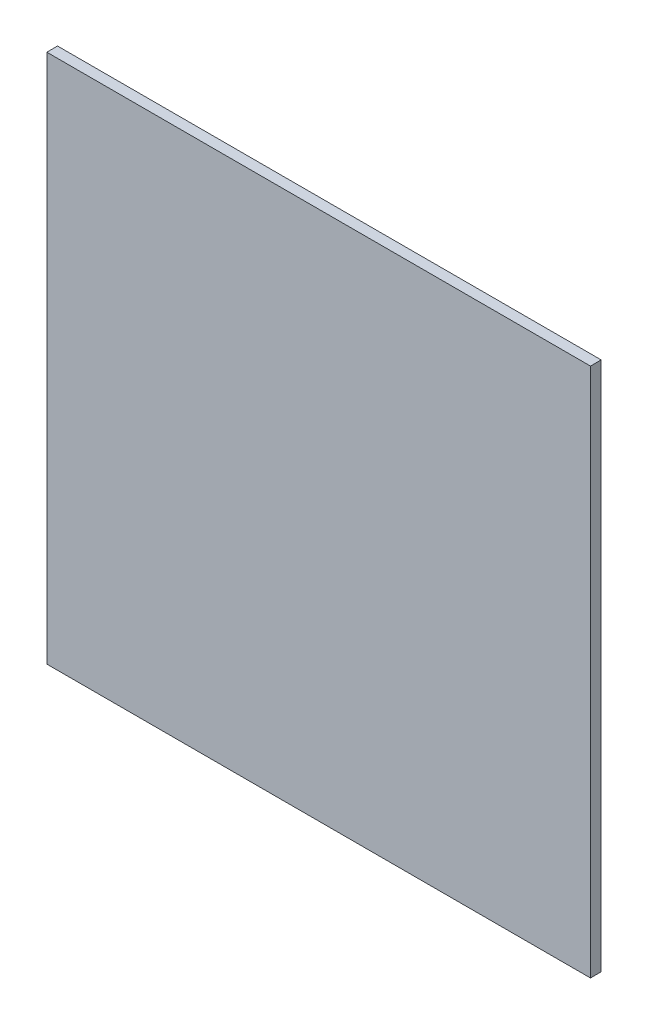
ISO-10303-21;
HEADER;
FILE_DESCRIPTION(('STEP AP214'),'2;1');
FILE_NAME('part.step','',(''),(''),'','','');
FILE_SCHEMA(('AUTOMOTIVE_DESIGN { 1 0 10303 214 1 1 1 1 }'));
ENDSEC;
DATA;
#1=APPLICATION_CONTEXT('core data for automotive mechanical design processes');
#2=APPLICATION_PROTOCOL_DEFINITION('international standard','automotive_design',2000,#1);
#3=PRODUCT_CONTEXT('',#1,'mechanical');
#4=PRODUCT('Part','Part','',(#3));
#5=PRODUCT_RELATED_PRODUCT_CATEGORY('part','',(#4));
#6=PRODUCT_DEFINITION_FORMATION('','',#4);
#7=PRODUCT_DEFINITION_CONTEXT('part definition',#1,'design');
#8=PRODUCT_DEFINITION('design','',#6,#7);
#9=PRODUCT_DEFINITION_SHAPE('','',#8);
#10=(LENGTH_UNIT() NAMED_UNIT(*) SI_UNIT(.MILLI.,.METRE.));
#11=(NAMED_UNIT(*) PLANE_ANGLE_UNIT() SI_UNIT($,.RADIAN.));
#12=(NAMED_UNIT(*) SI_UNIT($,.STERADIAN.) SOLID_ANGLE_UNIT());
#13=UNCERTAINTY_MEASURE_WITH_UNIT(LENGTH_MEASURE(1.E-05),#10,'distance_accuracy_value','');
#14=(GEOMETRIC_REPRESENTATION_CONTEXT(3) GLOBAL_UNCERTAINTY_ASSIGNED_CONTEXT((#13)) GLOBAL_UNIT_ASSIGNED_CONTEXT((#10,
#11,#12)) REPRESENTATION_CONTEXT('',''));
#15=CARTESIAN_POINT('',(0.,0.,0.));
#16=DIRECTION('',(0.,0.,1.));
#17=DIRECTION('',(1.,0.,0.));
#18=AXIS2_PLACEMENT_3D('',#15,#16,#17);
#19=CARTESIAN_POINT('',(0.254,-0.24759158,0.));
#20=DIRECTION('',(0.,-1.,0.));
#21=DIRECTION('',(-1.,0.,0.));
#22=AXIS2_PLACEMENT_3D('',#19,#20,#21);
#23=PLANE('',#22);
#24=DIRECTION('',(0.,0.,1.));
#25=VECTOR('',#24,1.);
#26=CARTESIAN_POINT('',(0.254,-0.24759158,0.));
#27=LINE('',#26,#25);
#28=CARTESIAN_POINT('',(0.254,-0.24759158,0.));
#29=VERTEX_POINT('',#28);
#30=CARTESIAN_POINT('',(0.254,-0.24759158,0.00999998));
#31=VERTEX_POINT('',#30);
#32=EDGE_CURVE('E11',#29,#31,#27,.T.);
#33=ORIENTED_EDGE('',*,*,#32,.T.);
#34=DIRECTION('',(-1.,0.,0.));
#35=VECTOR('',#34,1.);
#36=CARTESIAN_POINT('',(0.254,-0.24759158,0.00999998));
#37=LINE('',#36,#35);
#38=CARTESIAN_POINT('',(-0.25399746,-0.24759158,0.00999998));
#39=VERTEX_POINT('',#38);
#40=EDGE_CURVE('E25',#31,#39,#37,.T.);
#41=ORIENTED_EDGE('',*,*,#40,.T.);
#42=DIRECTION('',(0.,0.,1.));
#43=VECTOR('',#42,1.);
#44=CARTESIAN_POINT('',(-0.25399746,-0.24759158,0.));
#45=LINE('',#44,#43);
#46=CARTESIAN_POINT('',(-0.25399746,-0.24759158,0.));
#47=VERTEX_POINT('',#46);
#48=EDGE_CURVE('E73',#47,#39,#45,.T.);
#49=ORIENTED_EDGE('',*,*,#48,.F.);
#50=DIRECTION('',(-1.,0.,0.));
#51=VECTOR('',#50,1.);
#52=CARTESIAN_POINT('',(0.254,-0.24759158,0.));
#53=LINE('',#52,#51);
#54=EDGE_CURVE('E99',#29,#47,#53,.T.);
#55=ORIENTED_EDGE('',*,*,#54,.F.);
#56=EDGE_LOOP('',(#33,#41,#49,#55));
#57=FACE_BOUND('',#56,.T.);
#58=ADVANCED_FACE('F17',(#57),#23,.T.);
#59=CARTESIAN_POINT('',(9.484431609027E-07,-8.112099093644E-09,0.));
#60=DIRECTION('',(0.,0.,-1.));
#61=DIRECTION('',(-1.,0.,0.));
#62=AXIS2_PLACEMENT_3D('',#59,#60,#61);
#63=PLANE('',#62);
#64=ORIENTED_EDGE('',*,*,#54,.T.);
#65=DIRECTION('',(-5.1294151379532E-06,0.999999999986845,0.));
#66=VECTOR('',#65,1.);
#67=CARTESIAN_POINT('',(-0.25399746,-0.24759158,0.));
#68=LINE('',#67,#66);
#69=CARTESIAN_POINT('',(-0.254,0.24759158,0.));
#70=VERTEX_POINT('',#69);
#71=EDGE_CURVE('E95',#47,#70,#68,.T.);
#72=ORIENTED_EDGE('',*,*,#71,.T.);
#73=DIRECTION('',(0.9999999999875,-4.9999750500955E-06,0.));
#74=VECTOR('',#73,1.);
#75=CARTESIAN_POINT('',(-0.254,0.24759158,0.));
#76=LINE('',#75,#74);
#77=CARTESIAN_POINT('',(0.25400254,0.24758904,0.));
#78=VERTEX_POINT('',#77);
#79=EDGE_CURVE('E68',#70,#78,#76,.T.);
#80=ORIENTED_EDGE('',*,*,#79,.T.);
#81=DIRECTION('',(-5.1294415063842E-06,-0.999999999986845,0.));
#82=VECTOR('',#81,1.);
#83=CARTESIAN_POINT('',(0.25400254,0.24758904,0.));
#84=LINE('',#83,#82);
#85=EDGE_CURVE('E87',#78,#29,#84,.T.);
#86=ORIENTED_EDGE('',*,*,#85,.T.);
#87=EDGE_LOOP('',(#64,#72,#80,#86));
#88=FACE_BOUND('',#87,.T.);
#89=ADVANCED_FACE('F112',(#88),#63,.T.);
#90=CARTESIAN_POINT('',(0.25400254,0.24758904,0.));
#91=DIRECTION('',(0.999999999986845,-5.1294415063842E-06,0.));
#92=DIRECTION('',(-5.1294415063842E-06,-0.999999999986845,0.));
#93=AXIS2_PLACEMENT_3D('',#90,#91,#92);
#94=PLANE('',#93);
#95=DIRECTION('',(0.,0.,1.));
#96=VECTOR('',#95,1.);
#97=CARTESIAN_POINT('',(0.25400254,0.24758904,0.));
#98=LINE('',#97,#96);
#99=CARTESIAN_POINT('',(0.25400254,0.24758904,0.00999998));
#100=VERTEX_POINT('',#99);
#101=EDGE_CURVE('E83',#78,#100,#98,.T.);
#102=ORIENTED_EDGE('',*,*,#101,.T.);
#103=DIRECTION('',(-5.1294415063842E-06,-0.999999999986845,0.));
#104=VECTOR('',#103,1.);
#105=CARTESIAN_POINT('',(0.25400254,0.24758904,0.00999998));
#106=LINE('',#105,#104);
#107=EDGE_CURVE('E60',#100,#31,#106,.T.);
#108=ORIENTED_EDGE('',*,*,#107,.T.);
#109=ORIENTED_EDGE('',*,*,#32,.F.);
#110=ORIENTED_EDGE('',*,*,#85,.F.);
#111=EDGE_LOOP('',(#102,#108,#109,#110));
#112=FACE_BOUND('',#111,.T.);
#113=ADVANCED_FACE('F119',(#112),#94,.T.);
#114=CARTESIAN_POINT('',(9.484431609027E-07,-8.112099093644E-09,0.00999998));
#115=DIRECTION('',(0.,0.,-1.));
#116=DIRECTION('',(-1.,0.,0.));
#117=AXIS2_PLACEMENT_3D('',#114,#115,#116);
#118=PLANE('',#117);
#119=ORIENTED_EDGE('',*,*,#107,.F.);
#120=DIRECTION('',(0.9999999999875,-4.9999750500955E-06,0.));
#121=VECTOR('',#120,1.);
#122=CARTESIAN_POINT('',(-0.254,0.24759158,0.00999998));
#123=LINE('',#122,#121);
#124=CARTESIAN_POINT('',(-0.254,0.24759158,0.00999998));
#125=VERTEX_POINT('',#124);
#126=EDGE_CURVE('E54',#125,#100,#123,.T.);
#127=ORIENTED_EDGE('',*,*,#126,.F.);
#128=DIRECTION('',(-5.1294151379532E-06,0.999999999986845,0.));
#129=VECTOR('',#128,1.);
#130=CARTESIAN_POINT('',(-0.25399746,-0.24759158,0.00999998));
#131=LINE('',#130,#129);
#132=EDGE_CURVE('E58',#39,#125,#131,.T.);
#133=ORIENTED_EDGE('',*,*,#132,.F.);
#134=ORIENTED_EDGE('',*,*,#40,.F.);
#135=EDGE_LOOP('',(#119,#127,#133,#134));
#136=FACE_BOUND('',#135,.T.);
#137=ADVANCED_FACE('F56',(#136),#118,.F.);
#138=CARTESIAN_POINT('',(-0.25399746,-0.24759158,0.));
#139=DIRECTION('',(-0.999999999986845,-5.1294151379532E-06,0.));
#140=DIRECTION('',(-5.1294151379532E-06,0.999999999986845,0.));
#141=AXIS2_PLACEMENT_3D('',#138,#139,#140);
#142=PLANE('',#141);
#143=ORIENTED_EDGE('',*,*,#48,.T.);
#144=ORIENTED_EDGE('',*,*,#132,.T.);
#145=DIRECTION('',(0.,0.,1.));
#146=VECTOR('',#145,1.);
#147=CARTESIAN_POINT('',(-0.254,0.24759158,0.));
#148=LINE('',#147,#146);
#149=EDGE_CURVE('E66',#70,#125,#148,.T.);
#150=ORIENTED_EDGE('',*,*,#149,.F.);
#151=ORIENTED_EDGE('',*,*,#71,.F.);
#152=EDGE_LOOP('',(#143,#144,#150,#151));
#153=FACE_BOUND('',#152,.T.);
#154=ADVANCED_FACE('F72',(#153),#142,.T.);
#155=CARTESIAN_POINT('',(-0.254,0.24759158,0.));
#156=DIRECTION('',(4.9999750500955E-06,0.9999999999875,0.));
#157=DIRECTION('',(0.9999999999875,-4.9999750500955E-06,0.));
#158=AXIS2_PLACEMENT_3D('',#155,#156,#157);
#159=PLANE('',#158);
#160=ORIENTED_EDGE('',*,*,#149,.T.);
#161=ORIENTED_EDGE('',*,*,#126,.T.);
#162=ORIENTED_EDGE('',*,*,#101,.F.);
#163=ORIENTED_EDGE('',*,*,#79,.F.);
#164=EDGE_LOOP('',(#160,#161,#162,#163));
#165=FACE_BOUND('',#164,.T.);
#166=ADVANCED_FACE('F67',(#165),#159,.T.);
#167=CLOSED_SHELL('',(#58,#89,#113,#137,#154,#166));
#168=MANIFOLD_SOLID_BREP('B1',#167);
#169=ADVANCED_BREP_SHAPE_REPRESENTATION('',(#18,#168),#14);
#170=SHAPE_DEFINITION_REPRESENTATION(#9,#169);
ENDSEC;
END-ISO-10303-21;
